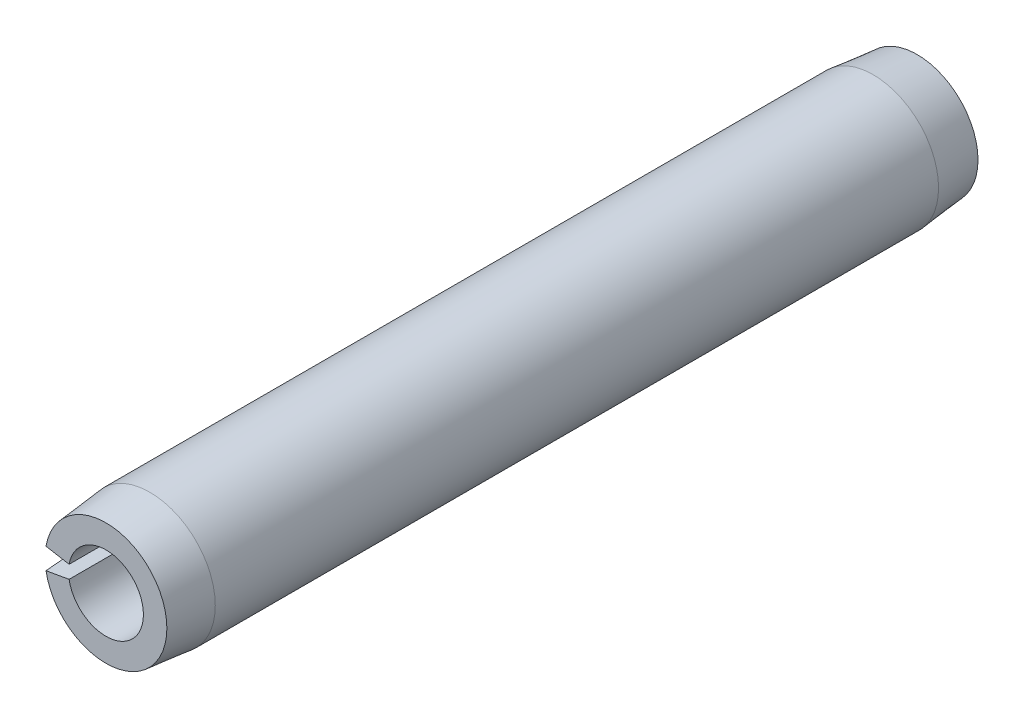
ISO-10303-21;
HEADER;
FILE_DESCRIPTION(('STEP AP214'),'2;1');
FILE_NAME('part.step','',(''),(''),'','','');
FILE_SCHEMA(('AUTOMOTIVE_DESIGN { 1 0 10303 214 1 1 1 1 }'));
ENDSEC;
DATA;
#1=APPLICATION_CONTEXT('core data for automotive mechanical design processes');
#2=APPLICATION_PROTOCOL_DEFINITION('international standard','automotive_design',2000,#1);
#3=PRODUCT_CONTEXT('',#1,'mechanical');
#4=PRODUCT('Part','Part','',(#3));
#5=PRODUCT_RELATED_PRODUCT_CATEGORY('part','',(#4));
#6=PRODUCT_DEFINITION_FORMATION('','',#4);
#7=PRODUCT_DEFINITION_CONTEXT('part definition',#1,'design');
#8=PRODUCT_DEFINITION('design','',#6,#7);
#9=PRODUCT_DEFINITION_SHAPE('','',#8);
#10=(LENGTH_UNIT() NAMED_UNIT(*) SI_UNIT(.MILLI.,.METRE.));
#11=(NAMED_UNIT(*) PLANE_ANGLE_UNIT() SI_UNIT($,.RADIAN.));
#12=(NAMED_UNIT(*) SI_UNIT($,.STERADIAN.) SOLID_ANGLE_UNIT());
#13=UNCERTAINTY_MEASURE_WITH_UNIT(LENGTH_MEASURE(1.E-05),#10,'distance_accuracy_value','');
#14=(GEOMETRIC_REPRESENTATION_CONTEXT(3) GLOBAL_UNCERTAINTY_ASSIGNED_CONTEXT((#13)) GLOBAL_UNIT_ASSIGNED_CONTEXT((#10,
#11,#12)) REPRESENTATION_CONTEXT('',''));
#15=CARTESIAN_POINT('',(0.,0.,0.));
#16=DIRECTION('',(0.,0.,1.));
#17=DIRECTION('',(1.,0.,0.));
#18=AXIS2_PLACEMENT_3D('',#15,#16,#17);
#19=CARTESIAN_POINT('',(0.,0.,10.31875));
#20=DIRECTION('',(0.,0.,1.));
#21=DIRECTION('',(1.,0.,0.));
#22=AXIS2_PLACEMENT_3D('',#19,#20,#21);
#23=PLANE('',#22);
#24=CARTESIAN_POINT('',(0.,0.,10.31875));
#25=DIRECTION('',(0.,0.,-1.));
#26=DIRECTION('',(-1.,0.,0.));
#27=AXIS2_PLACEMENT_3D('',#24,#25,#26);
#28=CIRCLE('',#27,0.9525);
#29=CARTESIAN_POINT('',(-0.938029384744128,0.165399889227748,10.31875));
#30=VERTEX_POINT('',#29);
#31=CARTESIAN_POINT('',(-0.938029384744128,-0.165399889227748,10.31875));
#32=VERTEX_POINT('',#31);
#33=EDGE_CURVE('E19',#30,#32,#28,.T.);
#34=ORIENTED_EDGE('',*,*,#33,.T.);
#35=DIRECTION('',(-0.984807753012208,-0.173648177666927,0.));
#36=VECTOR('',#35,1.);
#37=CARTESIAN_POINT('',(-0.938029384744128,-0.165399889227748,10.31875));
#38=LINE('',#37,#36);
#39=CARTESIAN_POINT('',(-1.52586113251451,-0.269050486476678,10.3187500000052));
#40=VERTEX_POINT('',#39);
#41=EDGE_CURVE('E75',#32,#40,#38,.T.);
#42=ORIENTED_EDGE('',*,*,#41,.T.);
#43=CARTESIAN_POINT('',(0.,0.,10.3187500000104));
#44=DIRECTION('',(0.,0.,-1.));
#45=DIRECTION('',(-1.,0.,0.));
#46=AXIS2_PLACEMENT_3D('',#43,#44,#45);
#47=CIRCLE('',#46,1.54939999999471);
#48=CARTESIAN_POINT('',(-1.52586113251604,0.269050486476657,10.3187500000078));
#49=VERTEX_POINT('',#48);
#50=EDGE_CURVE('E79',#49,#40,#47,.T.);
#51=ORIENTED_EDGE('',*,*,#50,.F.);
#52=DIRECTION('',(-0.984807753012209,0.173648177666927,0.));
#53=VECTOR('',#52,1.);
#54=CARTESIAN_POINT('',(-1.63842465868641,0.288898473184467,10.31875));
#55=LINE('',#54,#53);
#56=EDGE_CURVE('E77',#49,#30,#55,.F.);
#57=ORIENTED_EDGE('',*,*,#56,.T.);
#58=EDGE_LOOP('',(#34,#42,#51,#57));
#59=FACE_BOUND('',#58,.T.);
#60=ADVANCED_FACE('F16',(#59),#23,.T.);
#61=CARTESIAN_POINT('',(0.,0.,10.31875));
#62=DIRECTION('',(0.,0.,-1.));
#63=DIRECTION('',(-1.,0.,0.));
#64=AXIS2_PLACEMENT_3D('',#61,#62,#63);
#65=CYLINDRICAL_SURFACE('',#64,0.9525);
#66=DIRECTION('',(0.,0.,1.));
#67=VECTOR('',#66,1.);
#68=CARTESIAN_POINT('',(-0.938029384744128,-0.165399889227748,10.31875));
#69=LINE('',#68,#67);
#70=CARTESIAN_POINT('',(-0.938029384744128,-0.165399889227748,-10.31875));
#71=VERTEX_POINT('',#70);
#72=EDGE_CURVE('E72',#71,#32,#69,.T.);
#73=ORIENTED_EDGE('',*,*,#72,.T.);
#74=ORIENTED_EDGE('',*,*,#33,.F.);
#75=DIRECTION('',(0.,0.,1.));
#76=VECTOR('',#75,1.);
#77=CARTESIAN_POINT('',(-0.938029384744128,0.165399889227748,10.31875));
#78=LINE('',#77,#76);
#79=CARTESIAN_POINT('',(-0.938029384744128,0.165399889227748,-10.31875));
#80=VERTEX_POINT('',#79);
#81=EDGE_CURVE('E69',#30,#80,#78,.F.);
#82=ORIENTED_EDGE('',*,*,#81,.T.);
#83=CARTESIAN_POINT('',(0.,0.,-10.31875));
#84=DIRECTION('',(0.,0.,-1.));
#85=DIRECTION('',(-1.,0.,0.));
#86=AXIS2_PLACEMENT_3D('',#83,#84,#85);
#87=CIRCLE('',#86,0.9525);
#88=EDGE_CURVE('E74',#80,#71,#87,.T.);
#89=ORIENTED_EDGE('',*,*,#88,.T.);
#90=EDGE_LOOP('',(#73,#74,#82,#89));
#91=FACE_BOUND('',#90,.T.);
#92=ADVANCED_FACE('F67',(#91),#65,.F.);
#93=CARTESIAN_POINT('',(0.,0.,-10.31875));
#94=DIRECTION('',(0.,0.,1.));
#95=DIRECTION('',(1.,0.,0.));
#96=AXIS2_PLACEMENT_3D('',#93,#94,#95);
#97=PLANE('',#96);
#98=CARTESIAN_POINT('',(0.,0.,-10.3187500000104));
#99=DIRECTION('',(0.,0.,1.));
#100=DIRECTION('',(1.,0.,0.));
#101=AXIS2_PLACEMENT_3D('',#98,#99,#100);
#102=CIRCLE('',#101,1.54939999999471);
#103=CARTESIAN_POINT('',(-1.52586113251858,-0.269050486477103,-10.3187500000078));
#104=VERTEX_POINT('',#103);
#105=CARTESIAN_POINT('',(-1.52586113251604,0.269050486476657,-10.3187500000078));
#106=VERTEX_POINT('',#105);
#107=EDGE_CURVE('E94',#104,#106,#102,.T.);
#108=ORIENTED_EDGE('',*,*,#107,.F.);
#109=DIRECTION('',(0.984807753012209,0.173648177666927,0.));
#110=VECTOR('',#109,1.);
#111=CARTESIAN_POINT('',(-0.938029384744128,-0.165399889227748,-10.31875));
#112=LINE('',#111,#110);
#113=EDGE_CURVE('E98',#104,#71,#112,.T.);
#114=ORIENTED_EDGE('',*,*,#113,.T.);
#115=ORIENTED_EDGE('',*,*,#88,.F.);
#116=DIRECTION('',(-0.984807753012209,0.173648177666927,0.));
#117=VECTOR('',#116,1.);
#118=CARTESIAN_POINT('',(-1.63842465868641,0.288898473184467,-10.31875));
#119=LINE('',#118,#117);
#120=EDGE_CURVE('E83',#80,#106,#119,.T.);
#121=ORIENTED_EDGE('',*,*,#120,.T.);
#122=EDGE_LOOP('',(#108,#114,#115,#121));
#123=FACE_BOUND('',#122,.T.);
#124=ADVANCED_FACE('F135',(#123),#97,.F.);
#125=CARTESIAN_POINT('',(-1.63842465868641,0.288898473184467,10.31875));
#126=DIRECTION('',(0.173648177666927,0.984807753012209,0.));
#127=DIRECTION('',(-0.984807753012209,0.173648177666927,0.));
#128=AXIS2_PLACEMENT_3D('',#125,#126,#127);
#129=PLANE('',#128);
#130=DIRECTION('',(0.100196325582816,-0.0176673155681,0.99481081734183));
#131=VECTOR('',#130,1.);
#132=CARTESIAN_POINT('',(-50261.3335502556,8862.42919129754,-499000.));
#133=LINE('',#132,#131);
#134=CARTESIAN_POINT('',(-1.63842465869379,0.288898473185029,9.20114999996713));
#135=VERTEX_POINT('',#134);
#136=EDGE_CURVE('E82',#135,#49,#133,.T.);
#137=ORIENTED_EDGE('',*,*,#136,.F.);
#138=DIRECTION('',(0.,0.,-1.));
#139=VECTOR('',#138,1.);
#140=CARTESIAN_POINT('',(-1.63842465868641,0.288898473184467,10.31875));
#141=LINE('',#140,#139);
#142=CARTESIAN_POINT('',(-1.63842465868648,0.288898473184163,-9.20115000000596));
#143=VERTEX_POINT('',#142);
#144=EDGE_CURVE('E92',#143,#135,#141,.F.);
#145=ORIENTED_EDGE('',*,*,#144,.F.);
#146=DIRECTION('',(0.100196325582816,-0.0176673155681,-0.99481081734183));
#147=VECTOR('',#146,1.);
#148=CARTESIAN_POINT('',(-50261.3335502556,8862.42919129754,499000.));
#149=LINE('',#148,#147);
#150=EDGE_CURVE('E97',#106,#143,#149,.F.);
#151=ORIENTED_EDGE('',*,*,#150,.F.);
#152=ORIENTED_EDGE('',*,*,#120,.F.);
#153=ORIENTED_EDGE('',*,*,#81,.F.);
#154=ORIENTED_EDGE('',*,*,#56,.F.);
#155=EDGE_LOOP('',(#137,#145,#151,#152,#153,#154));
#156=FACE_BOUND('',#155,.T.);
#157=ADVANCED_FACE('F86',(#156),#129,.F.);
#158=CARTESIAN_POINT('',(0.,0.,9.20114999996713));
#159=DIRECTION('',(0.,0.,-1.));
#160=DIRECTION('',(-1.,0.,0.));
#161=AXIS2_PLACEMENT_3D('',#158,#159,#160);
#162=CONICAL_SURFACE('',#161,1.66370000000171,0.101918367483162);
#163=ORIENTED_EDGE('',*,*,#50,.T.);
#164=DIRECTION('',(-0.100196325582816,-0.0176673155680999,-0.99481081734183));
#165=VECTOR('',#164,1.);
#166=CARTESIAN_POINT('',(-1.52586113251712,-0.269050486477138,10.31875));
#167=LINE('',#166,#165);
#168=CARTESIAN_POINT('',(-1.638424658683,-0.288898473184749,9.20115000001199));
#169=VERTEX_POINT('',#168);
#170=EDGE_CURVE('E108',#40,#169,#167,.T.);
#171=ORIENTED_EDGE('',*,*,#170,.T.);
#172=CARTESIAN_POINT('',(0.,0.,9.20115));
#173=DIRECTION('',(0.,0.,-1.));
#174=DIRECTION('',(-1.,0.,0.));
#175=AXIS2_PLACEMENT_3D('',#172,#173,#174);
#176=CIRCLE('',#175,1.6637);
#177=EDGE_CURVE('E109',#135,#169,#176,.T.);
#178=ORIENTED_EDGE('',*,*,#177,.F.);
#179=ORIENTED_EDGE('',*,*,#136,.T.);
#180=EDGE_LOOP('',(#163,#171,#178,#179));
#181=FACE_BOUND('',#180,.T.);
#182=ADVANCED_FACE('F126',(#181),#162,.T.);
#183=CARTESIAN_POINT('',(-0.938029384744128,-0.165399889227748,10.31875));
#184=DIRECTION('',(0.173648177666927,-0.984807753012209,0.));
#185=DIRECTION('',(0.984807753012209,0.173648177666927,0.));
#186=AXIS2_PLACEMENT_3D('',#183,#184,#185);
#187=PLANE('',#186);
#188=ORIENTED_EDGE('',*,*,#170,.F.);
#189=ORIENTED_EDGE('',*,*,#41,.F.);
#190=ORIENTED_EDGE('',*,*,#72,.F.);
#191=ORIENTED_EDGE('',*,*,#113,.F.);
#192=DIRECTION('',(0.100196325582816,0.0176673155680998,-0.99481081734183));
#193=VECTOR('',#192,1.);
#194=CARTESIAN_POINT('',(-50261.3335502556,-8862.42919129739,499000.));
#195=LINE('',#194,#193);
#196=CARTESIAN_POINT('',(-1.63842465868648,-0.288898473184608,-9.20115000000599));
#197=VERTEX_POINT('',#196);
#198=EDGE_CURVE('E34',#197,#104,#195,.T.);
#199=ORIENTED_EDGE('',*,*,#198,.F.);
#200=DIRECTION('',(0.,0.,-1.));
#201=VECTOR('',#200,1.);
#202=CARTESIAN_POINT('',(-1.63842465868641,-0.288898473184466,10.31875));
#203=LINE('',#202,#201);
#204=EDGE_CURVE('E25',#169,#197,#203,.T.);
#205=ORIENTED_EDGE('',*,*,#204,.F.);
#206=EDGE_LOOP('',(#188,#189,#190,#191,#199,#205));
#207=FACE_BOUND('',#206,.T.);
#208=ADVANCED_FACE('F124',(#207),#187,.F.);
#209=CARTESIAN_POINT('',(0.,0.,-9.20114999996713));
#210=DIRECTION('',(0.,0.,1.));
#211=DIRECTION('',(1.,0.,0.));
#212=AXIS2_PLACEMENT_3D('',#209,#210,#211);
#213=CONICAL_SURFACE('',#212,1.66370000000171,0.101918367483162);
#214=ORIENTED_EDGE('',*,*,#150,.T.);
#215=CARTESIAN_POINT('',(0.,0.,-9.20115));
#216=DIRECTION('',(0.,0.,-1.));
#217=DIRECTION('',(-1.,0.,0.));
#218=AXIS2_PLACEMENT_3D('',#215,#216,#217);
#219=CIRCLE('',#218,1.6637);
#220=EDGE_CURVE('E11',#197,#143,#219,.F.);
#221=ORIENTED_EDGE('',*,*,#220,.F.);
#222=ORIENTED_EDGE('',*,*,#198,.T.);
#223=ORIENTED_EDGE('',*,*,#107,.T.);
#224=EDGE_LOOP('',(#214,#221,#222,#223));
#225=FACE_BOUND('',#224,.T.);
#226=ADVANCED_FACE('F122',(#225),#213,.T.);
#227=CARTESIAN_POINT('',(0.,0.,10.31875));
#228=DIRECTION('',(0.,0.,-1.));
#229=DIRECTION('',(-1.,0.,0.));
#230=AXIS2_PLACEMENT_3D('',#227,#228,#229);
#231=CYLINDRICAL_SURFACE('',#230,1.6637);
#232=ORIENTED_EDGE('',*,*,#220,.T.);
#233=ORIENTED_EDGE('',*,*,#144,.T.);
#234=ORIENTED_EDGE('',*,*,#177,.T.);
#235=ORIENTED_EDGE('',*,*,#204,.T.);
#236=EDGE_LOOP('',(#232,#233,#234,#235));
#237=FACE_BOUND('',#236,.T.);
#238=ADVANCED_FACE('F123',(#237),#231,.T.);
#239=CLOSED_SHELL('',(#60,#92,#124,#157,#182,#208,#226,#238));
#240=MANIFOLD_SOLID_BREP('B1',#239);
#241=ADVANCED_BREP_SHAPE_REPRESENTATION('',(#18,#240),#14);
#242=SHAPE_DEFINITION_REPRESENTATION(#9,#241);
ENDSEC;
END-ISO-10303-21;
